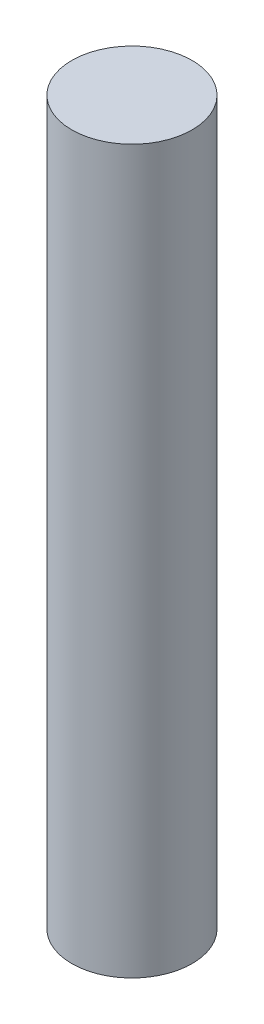
ISO-10303-21;
HEADER;
FILE_DESCRIPTION(('STEP AP214'),'2;1');
FILE_NAME('part.step','',(''),(''),'','','');
FILE_SCHEMA(('AUTOMOTIVE_DESIGN { 1 0 10303 214 1 1 1 1 }'));
ENDSEC;
DATA;
#1=APPLICATION_CONTEXT('core data for automotive mechanical design processes');
#2=APPLICATION_PROTOCOL_DEFINITION('international standard','automotive_design',2000,#1);
#3=PRODUCT_CONTEXT('',#1,'mechanical');
#4=PRODUCT('Part','Part','',(#3));
#5=PRODUCT_RELATED_PRODUCT_CATEGORY('part','',(#4));
#6=PRODUCT_DEFINITION_FORMATION('','',#4);
#7=PRODUCT_DEFINITION_CONTEXT('part definition',#1,'design');
#8=PRODUCT_DEFINITION('design','',#6,#7);
#9=PRODUCT_DEFINITION_SHAPE('','',#8);
#10=(LENGTH_UNIT() NAMED_UNIT(*) SI_UNIT(.MILLI.,.METRE.));
#11=(NAMED_UNIT(*) PLANE_ANGLE_UNIT() SI_UNIT($,.RADIAN.));
#12=(NAMED_UNIT(*) SI_UNIT($,.STERADIAN.) SOLID_ANGLE_UNIT());
#13=UNCERTAINTY_MEASURE_WITH_UNIT(LENGTH_MEASURE(1.E-05),#10,'distance_accuracy_value','');
#14=(GEOMETRIC_REPRESENTATION_CONTEXT(3) GLOBAL_UNCERTAINTY_ASSIGNED_CONTEXT((#13)) GLOBAL_UNIT_ASSIGNED_CONTEXT((#10,
#11,#12)) REPRESENTATION_CONTEXT('',''));
#15=CARTESIAN_POINT('',(0.,0.,0.));
#16=DIRECTION('',(0.,0.,1.));
#17=DIRECTION('',(1.,0.,0.));
#18=AXIS2_PLACEMENT_3D('',#15,#16,#17);
#19=CARTESIAN_POINT('',(0.,24.,0.));
#20=DIRECTION('',(0.,-1.,0.));
#21=DIRECTION('',(0.,0.,-1.));
#22=AXIS2_PLACEMENT_3D('',#19,#20,#21);
#23=CYLINDRICAL_SURFACE('',#22,2.);
#24=CARTESIAN_POINT('',(0.,24.,0.));
#25=DIRECTION('',(0.,1.,0.));
#26=DIRECTION('',(0.,0.,1.));
#27=AXIS2_PLACEMENT_3D('',#24,#25,#26);
#28=CIRCLE('',#27,2.);
#29=CARTESIAN_POINT('',(0.,24.,2.));
#30=VERTEX_POINT('',#29);
#31=EDGE_CURVE('E10',#30,#30,#28,.T.);
#32=ORIENTED_EDGE('',*,*,#31,.F.);
#33=EDGE_LOOP('',(#32));
#34=FACE_BOUND('',#33,.T.);
#35=CARTESIAN_POINT('',(0.,0.,0.));
#36=DIRECTION('',(0.,1.,0.));
#37=DIRECTION('',(0.,0.,1.));
#38=AXIS2_PLACEMENT_3D('',#35,#36,#37);
#39=CIRCLE('',#38,2.);
#40=CARTESIAN_POINT('',(0.,0.,2.));
#41=VERTEX_POINT('',#40);
#42=EDGE_CURVE('E34',#41,#41,#39,.T.);
#43=ORIENTED_EDGE('',*,*,#42,.T.);
#44=EDGE_LOOP('',(#43));
#45=FACE_BOUND('',#44,.T.);
#46=ADVANCED_FACE('F31',(#34,#45),#23,.T.);
#47=CARTESIAN_POINT('',(0.,24.,0.));
#48=DIRECTION('',(0.,1.,0.));
#49=DIRECTION('',(0.,0.,1.));
#50=AXIS2_PLACEMENT_3D('',#47,#48,#49);
#51=PLANE('',#50);
#52=ORIENTED_EDGE('',*,*,#31,.T.);
#53=EDGE_LOOP('',(#52));
#54=FACE_BOUND('',#53,.T.);
#55=ADVANCED_FACE('F46',(#54),#51,.T.);
#56=CARTESIAN_POINT('',(0.,0.,0.));
#57=DIRECTION('',(0.,1.,0.));
#58=DIRECTION('',(0.,0.,1.));
#59=AXIS2_PLACEMENT_3D('',#56,#57,#58);
#60=PLANE('',#59);
#61=ORIENTED_EDGE('',*,*,#42,.F.);
#62=EDGE_LOOP('',(#61));
#63=FACE_BOUND('',#62,.T.);
#64=ADVANCED_FACE('F44',(#63),#60,.F.);
#65=CLOSED_SHELL('',(#46,#55,#64));
#66=MANIFOLD_SOLID_BREP('B2',#65);
#67=ADVANCED_BREP_SHAPE_REPRESENTATION('',(#18,#66),#14);
#68=SHAPE_DEFINITION_REPRESENTATION(#9,#67);
ENDSEC;
END-ISO-10303-21;
